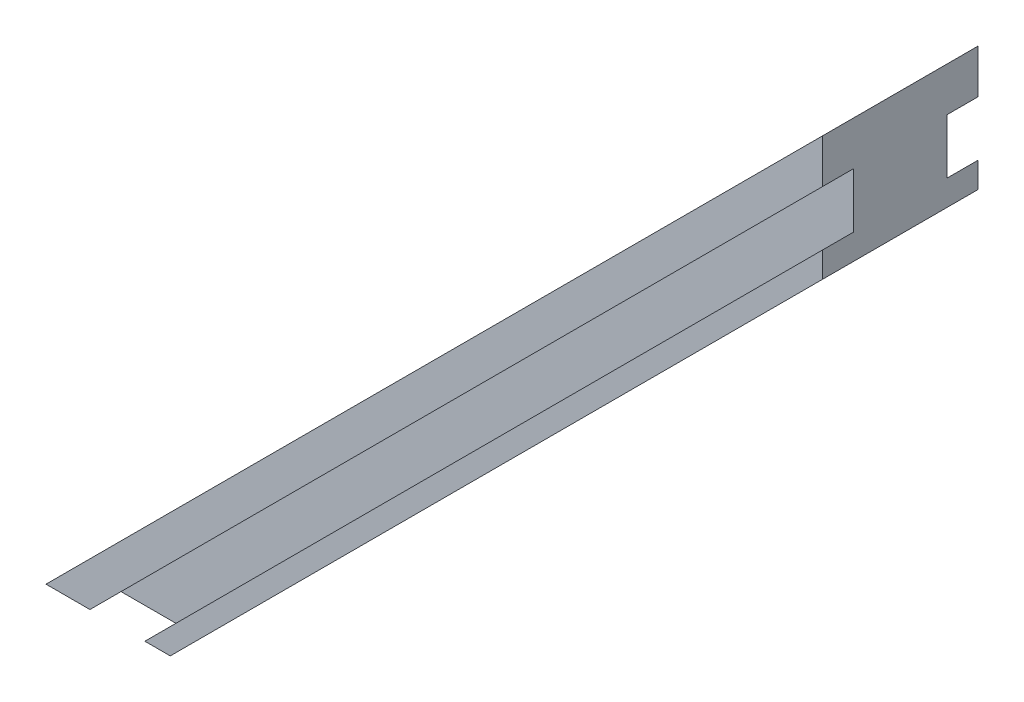
ISO-10303-21;
HEADER;
FILE_DESCRIPTION(('STEP AP214'),'2;1');
FILE_NAME('part.step','',(''),(''),'','','');
FILE_SCHEMA(('AUTOMOTIVE_DESIGN { 1 0 10303 214 1 1 1 1 }'));
ENDSEC;
DATA;
#1=APPLICATION_CONTEXT('core data for automotive mechanical design processes');
#2=APPLICATION_PROTOCOL_DEFINITION('international standard','automotive_design',2000,#1);
#3=PRODUCT_CONTEXT('',#1,'mechanical');
#4=PRODUCT('Part','Part','',(#3));
#5=PRODUCT_RELATED_PRODUCT_CATEGORY('part','',(#4));
#6=PRODUCT_DEFINITION_FORMATION('','',#4);
#7=PRODUCT_DEFINITION_CONTEXT('part definition',#1,'design');
#8=PRODUCT_DEFINITION('design','',#6,#7);
#9=PRODUCT_DEFINITION_SHAPE('','',#8);
#10=(LENGTH_UNIT() NAMED_UNIT(*) SI_UNIT(.MILLI.,.METRE.));
#11=(NAMED_UNIT(*) PLANE_ANGLE_UNIT() SI_UNIT($,.RADIAN.));
#12=(NAMED_UNIT(*) SI_UNIT($,.STERADIAN.) SOLID_ANGLE_UNIT());
#13=UNCERTAINTY_MEASURE_WITH_UNIT(LENGTH_MEASURE(1.E-05),#10,'distance_accuracy_value','');
#14=(GEOMETRIC_REPRESENTATION_CONTEXT(3) GLOBAL_UNCERTAINTY_ASSIGNED_CONTEXT((#13)) GLOBAL_UNIT_ASSIGNED_CONTEXT((#10,
#11,#12)) REPRESENTATION_CONTEXT('',''));
#15=CARTESIAN_POINT('',(0.,0.,0.));
#16=DIRECTION('',(0.,0.,1.));
#17=DIRECTION('',(1.,0.,0.));
#18=AXIS2_PLACEMENT_3D('',#15,#16,#17);
#19=CARTESIAN_POINT('',(-13.6776695296636,-14.6066017177983,0.));
#20=DIRECTION('',(0.707106781186549,-0.707106781186546,0.));
#21=DIRECTION('',(0.707106781186546,0.707106781186549,0.));
#22=AXIS2_PLACEMENT_3D('',#19,#20,#21);
#23=CYLINDRICAL_SURFACE('',#22,1.25);
#24=CARTESIAN_POINT('',(-10.1421356237309,-18.142135623731,0.));
#25=DIRECTION('',(-0.707106781186549,0.707106781186546,0.));
#26=DIRECTION('',(-0.707106781186546,-0.707106781186549,0.));
#27=AXIS2_PLACEMENT_3D('',#24,#25,#26);
#28=CIRCLE('',#27,1.25);
#29=CARTESIAN_POINT('',(-11.0260191002141,-19.0260191002142,0.));
#30=VERTEX_POINT('',#29);
#31=EDGE_CURVE('E210',#30,#30,#28,.T.);
#32=ORIENTED_EDGE('',*,*,#31,.F.);
#33=EDGE_LOOP('',(#32));
#34=FACE_BOUND('',#33,.T.);
#35=CARTESIAN_POINT('',(-13.0814754519511,-15.2027957955108,0.));
#36=DIRECTION('',(-0.707106781186549,0.707106781186546,0.));
#37=DIRECTION('',(-0.707106781186546,-0.707106781186549,0.));
#38=AXIS2_PLACEMENT_3D('',#35,#36,#37);
#39=CIRCLE('',#38,1.25);
#40=CARTESIAN_POINT('',(-13.9653589284343,-16.086679271994,0.));
#41=VERTEX_POINT('',#40);
#42=EDGE_CURVE('E40',#41,#41,#39,.T.);
#43=ORIENTED_EDGE('',*,*,#42,.T.);
#44=EDGE_LOOP('',(#43));
#45=FACE_BOUND('',#44,.T.);
#46=ADVANCED_FACE('F36',(#34,#45),#23,.F.);
#47=CARTESIAN_POINT('',(14.6066017177982,13.6776695296637,0.));
#48=DIRECTION('',(0.707106781186549,-0.707106781186546,0.));
#49=DIRECTION('',(0.707106781186546,0.707106781186549,0.));
#50=AXIS2_PLACEMENT_3D('',#47,#48,#49);
#51=CYLINDRICAL_SURFACE('',#50,1.25);
#52=CARTESIAN_POINT('',(18.1421356237309,10.142135623731,0.));
#53=DIRECTION('',(-0.707106781186549,0.707106781186546,0.));
#54=DIRECTION('',(-0.707106781186546,-0.707106781186549,0.));
#55=AXIS2_PLACEMENT_3D('',#52,#53,#54);
#56=CIRCLE('',#55,1.25);
#57=CARTESIAN_POINT('',(17.2582521472477,9.25825214724781,0.));
#58=VERTEX_POINT('',#57);
#59=EDGE_CURVE('E243',#58,#58,#56,.T.);
#60=ORIENTED_EDGE('',*,*,#59,.F.);
#61=EDGE_LOOP('',(#60));
#62=FACE_BOUND('',#61,.T.);
#63=CARTESIAN_POINT('',(15.2027957955107,13.0814754519512,0.));
#64=DIRECTION('',(-0.707106781186549,0.707106781186546,0.));
#65=DIRECTION('',(-0.707106781186546,-0.707106781186549,0.));
#66=AXIS2_PLACEMENT_3D('',#63,#64,#65);
#67=CIRCLE('',#66,1.25);
#68=CARTESIAN_POINT('',(14.3189123190276,12.197591975468,0.));
#69=VERTEX_POINT('',#68);
#70=EDGE_CURVE('E208',#69,#69,#67,.T.);
#71=ORIENTED_EDGE('',*,*,#70,.T.);
#72=EDGE_LOOP('',(#71));
#73=FACE_BOUND('',#72,.T.);
#74=ADVANCED_FACE('F303',(#62,#73),#51,.F.);
#75=CARTESIAN_POINT('',(-25.,-25.0000000000001,5.));
#76=DIRECTION('',(0.,1.,0.));
#77=DIRECTION('',(0.,0.,1.));
#78=AXIS2_PLACEMENT_3D('',#75,#76,#77);
#79=PLANE('',#78);
#80=DIRECTION('',(0.,0.,-1.));
#81=VECTOR('',#80,1.);
#82=CARTESIAN_POINT('',(-22.171572875254,-25.0000000000001,-3.));
#83=LINE('',#82,#81);
#84=CARTESIAN_POINT('',(-22.171572875254,-25.0000000000001,-3.));
#85=VERTEX_POINT('',#84);
#86=CARTESIAN_POINT('',(-22.171572875254,-25.0000000000001,-5.));
#87=VERTEX_POINT('',#86);
#88=EDGE_CURVE('E150',#85,#87,#83,.T.);
#89=ORIENTED_EDGE('',*,*,#88,.F.);
#90=DIRECTION('',(1.,0.,0.));
#91=VECTOR('',#90,1.);
#92=CARTESIAN_POINT('',(-22.171572875254,-25.0000000000001,-3.));
#93=LINE('',#92,#91);
#94=CARTESIAN_POINT('',(-18.6360389693213,-25.0000000000001,-3.));
#95=VERTEX_POINT('',#94);
#96=EDGE_CURVE('E133',#85,#95,#93,.T.);
#97=ORIENTED_EDGE('',*,*,#96,.T.);
#98=DIRECTION('',(0.,0.,-1.));
#99=VECTOR('',#98,1.);
#100=CARTESIAN_POINT('',(-18.6360389693213,-25.0000000000001,-3.));
#101=LINE('',#100,#99);
#102=CARTESIAN_POINT('',(-18.6360389693213,-25.0000000000001,-5.));
#103=VERTEX_POINT('',#102);
#104=EDGE_CURVE('E129',#95,#103,#101,.T.);
#105=ORIENTED_EDGE('',*,*,#104,.T.);
#106=DIRECTION('',(1.,0.,0.));
#107=VECTOR('',#106,1.);
#108=CARTESIAN_POINT('',(-25.,-25.0000000000001,-5.));
#109=LINE('',#108,#107);
#110=CARTESIAN_POINT('',(-17.,-25.0000000000001,-5.));
#111=VERTEX_POINT('',#110);
#112=EDGE_CURVE('E174',#103,#111,#109,.T.);
#113=ORIENTED_EDGE('',*,*,#112,.T.);
#114=DIRECTION('',(0.,0.,-1.));
#115=VECTOR('',#114,1.);
#116=CARTESIAN_POINT('',(-17.,-25.0000000000001,5.));
#117=LINE('',#116,#115);
#118=CARTESIAN_POINT('',(-17.,-25.0000000000001,5.));
#119=VERTEX_POINT('',#118);
#120=EDGE_CURVE('E12',#119,#111,#117,.T.);
#121=ORIENTED_EDGE('',*,*,#120,.F.);
#122=DIRECTION('',(1.,0.,0.));
#123=VECTOR('',#122,1.);
#124=CARTESIAN_POINT('',(-25.,-25.0000000000001,5.));
#125=LINE('',#124,#123);
#126=CARTESIAN_POINT('',(-18.6360389693213,-25.0000000000001,5.));
#127=VERTEX_POINT('',#126);
#128=EDGE_CURVE('E185',#127,#119,#125,.T.);
#129=ORIENTED_EDGE('',*,*,#128,.F.);
#130=DIRECTION('',(0.,0.,1.));
#131=VECTOR('',#130,1.);
#132=CARTESIAN_POINT('',(-18.6360389693213,-25.0000000000001,3.));
#133=LINE('',#132,#131);
#134=CARTESIAN_POINT('',(-18.6360389693213,-25.0000000000001,3.));
#135=VERTEX_POINT('',#134);
#136=EDGE_CURVE('E175',#135,#127,#133,.T.);
#137=ORIENTED_EDGE('',*,*,#136,.F.);
#138=DIRECTION('',(1.,0.,0.));
#139=VECTOR('',#138,1.);
#140=CARTESIAN_POINT('',(-22.171572875254,-25.0000000000001,3.));
#141=LINE('',#140,#139);
#142=CARTESIAN_POINT('',(-22.171572875254,-25.0000000000001,3.));
#143=VERTEX_POINT('',#142);
#144=EDGE_CURVE('E162',#143,#135,#141,.T.);
#145=ORIENTED_EDGE('',*,*,#144,.F.);
#146=DIRECTION('',(0.,0.,1.));
#147=VECTOR('',#146,1.);
#148=CARTESIAN_POINT('',(-22.171572875254,-25.0000000000001,3.));
#149=LINE('',#148,#147);
#150=CARTESIAN_POINT('',(-22.171572875254,-25.0000000000001,5.));
#151=VERTEX_POINT('',#150);
#152=EDGE_CURVE('E177',#143,#151,#149,.T.);
#153=ORIENTED_EDGE('',*,*,#152,.T.);
#154=CARTESIAN_POINT('',(-25.,-25.0000000000001,5.));
#155=VERTEX_POINT('',#154);
#156=EDGE_CURVE('E181',#155,#151,#125,.T.);
#157=ORIENTED_EDGE('',*,*,#156,.F.);
#158=DIRECTION('',(0.,0.,-1.));
#159=VECTOR('',#158,1.);
#160=CARTESIAN_POINT('',(-25.,-25.0000000000001,5.));
#161=LINE('',#160,#159);
#162=CARTESIAN_POINT('',(-25.,-25.0000000000001,-5.));
#163=VERTEX_POINT('',#162);
#164=EDGE_CURVE('E193',#155,#163,#161,.T.);
#165=ORIENTED_EDGE('',*,*,#164,.T.);
#166=EDGE_CURVE('E194',#163,#87,#109,.T.);
#167=ORIENTED_EDGE('',*,*,#166,.T.);
#168=EDGE_LOOP('',(#89,#97,#105,#113,#121,#129,#137,#145,#153,#157,#165,#167));
#169=FACE_BOUND('',#168,.T.);
#170=ADVANCED_FACE('F38',(#169),#79,.F.);
#171=CARTESIAN_POINT('',(25.,25.0000000000001,5.));
#172=DIRECTION('',(-1.,0.,0.));
#173=DIRECTION('',(0.,0.,1.));
#174=AXIS2_PLACEMENT_3D('',#171,#172,#173);
#175=PLANE('',#174);
#176=DIRECTION('',(0.,0.,-1.));
#177=VECTOR('',#176,1.);
#178=CARTESIAN_POINT('',(25.,22.1715728752539,-3.));
#179=LINE('',#178,#177);
#180=CARTESIAN_POINT('',(25.,22.1715728752539,-3.));
#181=VERTEX_POINT('',#180);
#182=CARTESIAN_POINT('',(25.,22.1715728752539,-5.));
#183=VERTEX_POINT('',#182);
#184=EDGE_CURVE('E169',#181,#183,#179,.T.);
#185=ORIENTED_EDGE('',*,*,#184,.T.);
#186=DIRECTION('',(0.,1.,0.));
#187=VECTOR('',#186,1.);
#188=CARTESIAN_POINT('',(25.,25.0000000000001,-5.));
#189=LINE('',#188,#187);
#190=CARTESIAN_POINT('',(25.,25.0000000000001,-5.));
#191=VERTEX_POINT('',#190);
#192=EDGE_CURVE('E199',#183,#191,#189,.T.);
#193=ORIENTED_EDGE('',*,*,#192,.T.);
#194=DIRECTION('',(0.,0.,-1.));
#195=VECTOR('',#194,1.);
#196=CARTESIAN_POINT('',(25.,25.0000000000001,5.));
#197=LINE('',#196,#195);
#198=CARTESIAN_POINT('',(25.,25.0000000000001,5.));
#199=VERTEX_POINT('',#198);
#200=EDGE_CURVE('E205',#199,#191,#197,.T.);
#201=ORIENTED_EDGE('',*,*,#200,.F.);
#202=DIRECTION('',(0.,1.,0.));
#203=VECTOR('',#202,1.);
#204=CARTESIAN_POINT('',(25.,25.0000000000001,5.));
#205=LINE('',#204,#203);
#206=CARTESIAN_POINT('',(25.,22.1715728752539,5.));
#207=VERTEX_POINT('',#206);
#208=EDGE_CURVE('E187',#207,#199,#205,.T.);
#209=ORIENTED_EDGE('',*,*,#208,.F.);
#210=DIRECTION('',(0.,0.,1.));
#211=VECTOR('',#210,1.);
#212=CARTESIAN_POINT('',(25.,22.1715728752539,3.));
#213=LINE('',#212,#211);
#214=CARTESIAN_POINT('',(25.,22.1715728752539,3.));
#215=VERTEX_POINT('',#214);
#216=EDGE_CURVE('E61',#215,#207,#213,.T.);
#217=ORIENTED_EDGE('',*,*,#216,.F.);
#218=DIRECTION('',(0.,1.,0.));
#219=VECTOR('',#218,1.);
#220=CARTESIAN_POINT('',(25.,18.6360389693212,3.));
#221=LINE('',#220,#219);
#222=CARTESIAN_POINT('',(25.,18.6360389693212,3.));
#223=VERTEX_POINT('',#222);
#224=EDGE_CURVE('E155',#223,#215,#221,.T.);
#225=ORIENTED_EDGE('',*,*,#224,.F.);
#226=DIRECTION('',(0.,0.,1.));
#227=VECTOR('',#226,1.);
#228=CARTESIAN_POINT('',(25.,18.6360389693212,3.));
#229=LINE('',#228,#227);
#230=CARTESIAN_POINT('',(25.,18.6360389693212,5.));
#231=VERTEX_POINT('',#230);
#232=EDGE_CURVE('E171',#223,#231,#229,.T.);
#233=ORIENTED_EDGE('',*,*,#232,.T.);
#234=CARTESIAN_POINT('',(25.,17.0000000000001,5.));
#235=VERTEX_POINT('',#234);
#236=EDGE_CURVE('E188',#235,#231,#205,.T.);
#237=ORIENTED_EDGE('',*,*,#236,.F.);
#238=DIRECTION('',(0.,0.,-1.));
#239=VECTOR('',#238,1.);
#240=CARTESIAN_POINT('',(25.,17.0000000000001,5.));
#241=LINE('',#240,#239);
#242=CARTESIAN_POINT('',(25.,17.0000000000001,-5.));
#243=VERTEX_POINT('',#242);
#244=EDGE_CURVE('E45',#235,#243,#241,.T.);
#245=ORIENTED_EDGE('',*,*,#244,.T.);
#246=CARTESIAN_POINT('',(25.,18.6360389693212,-5.));
#247=VERTEX_POINT('',#246);
#248=EDGE_CURVE('E148',#243,#247,#189,.T.);
#249=ORIENTED_EDGE('',*,*,#248,.T.);
#250=DIRECTION('',(0.,0.,-1.));
#251=VECTOR('',#250,1.);
#252=CARTESIAN_POINT('',(25.,18.6360389693212,-3.));
#253=LINE('',#252,#251);
#254=CARTESIAN_POINT('',(25.,18.6360389693212,-3.));
#255=VERTEX_POINT('',#254);
#256=EDGE_CURVE('E53',#255,#247,#253,.T.);
#257=ORIENTED_EDGE('',*,*,#256,.F.);
#258=DIRECTION('',(0.,1.,0.));
#259=VECTOR('',#258,1.);
#260=CARTESIAN_POINT('',(25.,18.6360389693212,-3.));
#261=LINE('',#260,#259);
#262=EDGE_CURVE('E134',#255,#181,#261,.T.);
#263=ORIENTED_EDGE('',*,*,#262,.T.);
#264=EDGE_LOOP('',(#185,#193,#201,#209,#217,#225,#233,#237,#245,#249,#257,#263));
#265=FACE_BOUND('',#264,.T.);
#266=ADVANCED_FACE('F145',(#265),#175,.F.);
#267=CARTESIAN_POINT('',(0.,0.,-5.));
#268=DIRECTION('',(0.,0.,-1.));
#269=DIRECTION('',(-1.,0.,0.));
#270=AXIS2_PLACEMENT_3D('',#267,#268,#269);
#271=PLANE('',#270);
#272=ORIENTED_EDGE('',*,*,#192,.F.);
#273=DIRECTION('',(-0.707106781186547,-0.707106781186548,0.));
#274=VECTOR('',#273,1.);
#275=CARTESIAN_POINT('',(25.,22.1715728752539,-5.));
#276=LINE('',#275,#274);
#277=EDGE_CURVE('E142',#183,#87,#276,.T.);
#278=ORIENTED_EDGE('',*,*,#277,.T.);
#279=ORIENTED_EDGE('',*,*,#166,.F.);
#280=DIRECTION('',(-0.707106781186546,-0.707106781186549,0.));
#281=VECTOR('',#280,1.);
#282=CARTESIAN_POINT('',(-25.,-25.0000000000001,-5.));
#283=LINE('',#282,#281);
#284=EDGE_CURVE('E201',#191,#163,#283,.T.);
#285=ORIENTED_EDGE('',*,*,#284,.F.);
#286=EDGE_LOOP('',(#272,#278,#279,#285));
#287=FACE_BOUND('',#286,.T.);
#288=ADVANCED_FACE('F260',(#287),#271,.T.);
#289=ORIENTED_EDGE('',*,*,#112,.F.);
#290=DIRECTION('',(0.707106781186547,0.707106781186548,0.));
#291=VECTOR('',#290,1.);
#292=CARTESIAN_POINT('',(-18.6360389693213,-25.0000000000001,-5.));
#293=LINE('',#292,#291);
#294=EDGE_CURVE('E247',#103,#247,#293,.T.);
#295=ORIENTED_EDGE('',*,*,#294,.T.);
#296=ORIENTED_EDGE('',*,*,#248,.F.);
#297=DIRECTION('',(0.707106781186546,0.70710678118655,0.));
#298=VECTOR('',#297,1.);
#299=CARTESIAN_POINT('',(-17.,-25.0000000000001,-5.));
#300=LINE('',#299,#298);
#301=EDGE_CURVE('E197',#111,#243,#300,.T.);
#302=ORIENTED_EDGE('',*,*,#301,.F.);
#303=EDGE_LOOP('',(#289,#295,#296,#302));
#304=FACE_BOUND('',#303,.T.);
#305=ADVANCED_FACE('F293',(#304),#271,.T.);
#306=CARTESIAN_POINT('',(0.,0.,5.));
#307=DIRECTION('',(0.,0.,-1.));
#308=DIRECTION('',(-1.,0.,0.));
#309=AXIS2_PLACEMENT_3D('',#306,#307,#308);
#310=PLANE('',#309);
#311=ORIENTED_EDGE('',*,*,#236,.T.);
#312=DIRECTION('',(0.707106781186547,0.707106781186548,0.));
#313=VECTOR('',#312,1.);
#314=CARTESIAN_POINT('',(-18.6360389693213,-25.0000000000001,5.));
#315=LINE('',#314,#313);
#316=EDGE_CURVE('E159',#127,#231,#315,.T.);
#317=ORIENTED_EDGE('',*,*,#316,.F.);
#318=ORIENTED_EDGE('',*,*,#128,.T.);
#319=DIRECTION('',(0.707106781186546,0.70710678118655,0.));
#320=VECTOR('',#319,1.);
#321=CARTESIAN_POINT('',(-17.,-25.0000000000001,5.));
#322=LINE('',#321,#320);
#323=EDGE_CURVE('E184',#119,#235,#322,.T.);
#324=ORIENTED_EDGE('',*,*,#323,.T.);
#325=EDGE_LOOP('',(#311,#317,#318,#324));
#326=FACE_BOUND('',#325,.T.);
#327=ADVANCED_FACE('F284',(#326),#310,.F.);
#328=CARTESIAN_POINT('',(-17.,-25.0000000000001,5.));
#329=DIRECTION('',(-0.70710678118655,0.707106781186546,0.));
#330=DIRECTION('',(-0.707106781186546,-0.70710678118655,0.));
#331=AXIS2_PLACEMENT_3D('',#328,#329,#330);
#332=PLANE('',#331);
#333=CARTESIAN_POINT('',(4.00000000000001,-3.99999999999999,0.));
#334=DIRECTION('',(-0.707106781186549,0.707106781186546,0.));
#335=DIRECTION('',(-0.707106781186546,-0.707106781186549,0.));
#336=AXIS2_PLACEMENT_3D('',#333,#334,#335);
#337=CIRCLE('',#336,1.25);
#338=CARTESIAN_POINT('',(3.11611652351683,-4.88388347648318,0.));
#339=VERTEX_POINT('',#338);
#340=EDGE_CURVE('E232',#339,#339,#337,.T.);
#341=ORIENTED_EDGE('',*,*,#340,.T.);
#342=EDGE_LOOP('',(#341));
#343=FACE_BOUND('',#342,.T.);
#344=CARTESIAN_POINT('',(-3.07106781186544,-11.0710678118655,0.));
#345=DIRECTION('',(-0.707106781186549,0.707106781186546,0.));
#346=DIRECTION('',(-0.707106781186546,-0.707106781186549,0.));
#347=AXIS2_PLACEMENT_3D('',#344,#345,#346);
#348=CIRCLE('',#347,1.25);
#349=CARTESIAN_POINT('',(-3.95495128834863,-11.9549512883487,0.));
#350=VERTEX_POINT('',#349);
#351=EDGE_CURVE('E215',#350,#350,#348,.T.);
#352=ORIENTED_EDGE('',*,*,#351,.T.);
#353=EDGE_LOOP('',(#352));
#354=FACE_BOUND('',#353,.T.);
#355=ORIENTED_EDGE('',*,*,#31,.T.);
#356=EDGE_LOOP('',(#355));
#357=FACE_BOUND('',#356,.T.);
#358=CARTESIAN_POINT('',(11.0710678118655,3.0710678118655,0.));
#359=DIRECTION('',(-0.707106781186549,0.707106781186546,0.));
#360=DIRECTION('',(-0.707106781186546,-0.707106781186549,0.));
#361=AXIS2_PLACEMENT_3D('',#358,#359,#360);
#362=CIRCLE('',#361,1.25);
#363=CARTESIAN_POINT('',(10.1871843353823,2.18718433538231,0.));
#364=VERTEX_POINT('',#363);
#365=EDGE_CURVE('E231',#364,#364,#362,.T.);
#366=ORIENTED_EDGE('',*,*,#365,.T.);
#367=EDGE_LOOP('',(#366));
#368=FACE_BOUND('',#367,.T.);
#369=ORIENTED_EDGE('',*,*,#59,.T.);
#370=EDGE_LOOP('',(#369));
#371=FACE_BOUND('',#370,.T.);
#372=ORIENTED_EDGE('',*,*,#301,.T.);
#373=ORIENTED_EDGE('',*,*,#244,.F.);
#374=ORIENTED_EDGE('',*,*,#323,.F.);
#375=ORIENTED_EDGE('',*,*,#120,.T.);
#376=EDGE_LOOP('',(#372,#373,#374,#375));
#377=FACE_BOUND('',#376,.T.);
#378=ADVANCED_FACE('F289',(#343,#354,#357,#368,#371,#377),#332,.F.);
#379=CARTESIAN_POINT('',(-25.,-25.0000000000001,5.));
#380=DIRECTION('',(0.707106781186549,-0.707106781186546,0.));
#381=DIRECTION('',(0.707106781186546,0.707106781186549,0.));
#382=AXIS2_PLACEMENT_3D('',#379,#380,#381);
#383=PLANE('',#382);
#384=CARTESIAN_POINT('',(-14.1421356237309,-14.142135623731,0.));
#385=DIRECTION('',(-0.707106781186549,0.707106781186546,0.));
#386=DIRECTION('',(-0.707106781186546,-0.707106781186549,0.));
#387=AXIS2_PLACEMENT_3D('',#384,#385,#386);
#388=CIRCLE('',#387,3.5);
#389=CARTESIAN_POINT('',(-16.6170093578838,-16.6170093578839,0.));
#390=VERTEX_POINT('',#389);
#391=EDGE_CURVE('E225',#390,#390,#388,.T.);
#392=ORIENTED_EDGE('',*,*,#391,.F.);
#393=EDGE_LOOP('',(#392));
#394=FACE_BOUND('',#393,.T.);
#395=CARTESIAN_POINT('',(14.1421356237309,14.142135623731,0.));
#396=DIRECTION('',(-0.707106781186549,0.707106781186546,0.));
#397=DIRECTION('',(-0.707106781186546,-0.707106781186549,0.));
#398=AXIS2_PLACEMENT_3D('',#395,#396,#397);
#399=CIRCLE('',#398,3.5);
#400=CARTESIAN_POINT('',(11.667261889578,11.6672618895781,0.));
#401=VERTEX_POINT('',#400);
#402=EDGE_CURVE('E218',#401,#401,#399,.T.);
#403=ORIENTED_EDGE('',*,*,#402,.F.);
#404=EDGE_LOOP('',(#403));
#405=FACE_BOUND('',#404,.T.);
#406=ORIENTED_EDGE('',*,*,#284,.T.);
#407=ORIENTED_EDGE('',*,*,#164,.F.);
#408=DIRECTION('',(-0.707106781186546,-0.707106781186549,0.));
#409=VECTOR('',#408,1.);
#410=CARTESIAN_POINT('',(-25.,-25.0000000000001,5.));
#411=LINE('',#410,#409);
#412=EDGE_CURVE('E191',#199,#155,#411,.T.);
#413=ORIENTED_EDGE('',*,*,#412,.F.);
#414=ORIENTED_EDGE('',*,*,#200,.T.);
#415=EDGE_LOOP('',(#406,#407,#413,#414));
#416=FACE_BOUND('',#415,.T.);
#417=ADVANCED_FACE('F266',(#394,#405,#416),#383,.F.);
#418=ORIENTED_EDGE('',*,*,#156,.T.);
#419=DIRECTION('',(-0.707106781186547,-0.707106781186548,0.));
#420=VECTOR('',#419,1.);
#421=CARTESIAN_POINT('',(25.,22.1715728752539,5.));
#422=LINE('',#421,#420);
#423=EDGE_CURVE('E167',#207,#151,#422,.T.);
#424=ORIENTED_EDGE('',*,*,#423,.F.);
#425=ORIENTED_EDGE('',*,*,#208,.T.);
#426=ORIENTED_EDGE('',*,*,#412,.T.);
#427=EDGE_LOOP('',(#418,#424,#425,#426));
#428=FACE_BOUND('',#427,.T.);
#429=ADVANCED_FACE('F271',(#428),#310,.F.);
#430=CARTESIAN_POINT('',(-18.6360389693213,-25.0000000000001,3.));
#431=DIRECTION('',(0.707106781186548,-0.707106781186547,0.));
#432=DIRECTION('',(0.707106781186547,0.707106781186548,0.));
#433=AXIS2_PLACEMENT_3D('',#430,#431,#432);
#434=PLANE('',#433);
#435=ORIENTED_EDGE('',*,*,#316,.T.);
#436=ORIENTED_EDGE('',*,*,#232,.F.);
#437=DIRECTION('',(0.707106781186547,0.707106781186548,0.));
#438=VECTOR('',#437,1.);
#439=CARTESIAN_POINT('',(-18.6360389693213,-25.0000000000001,3.));
#440=LINE('',#439,#438);
#441=EDGE_CURVE('E164',#135,#223,#440,.T.);
#442=ORIENTED_EDGE('',*,*,#441,.F.);
#443=ORIENTED_EDGE('',*,*,#136,.T.);
#444=EDGE_LOOP('',(#435,#436,#442,#443));
#445=FACE_BOUND('',#444,.T.);
#446=ADVANCED_FACE('F280',(#445),#434,.F.);
#447=CARTESIAN_POINT('',(25.,22.1715728752539,3.));
#448=DIRECTION('',(-0.707106781186548,0.707106781186547,0.));
#449=DIRECTION('',(-0.707106781186547,-0.707106781186548,0.));
#450=AXIS2_PLACEMENT_3D('',#447,#448,#449);
#451=PLANE('',#450);
#452=ORIENTED_EDGE('',*,*,#423,.T.);
#453=ORIENTED_EDGE('',*,*,#152,.F.);
#454=DIRECTION('',(-0.707106781186547,-0.707106781186548,0.));
#455=VECTOR('',#454,1.);
#456=CARTESIAN_POINT('',(25.,22.1715728752539,3.));
#457=LINE('',#456,#455);
#458=EDGE_CURVE('E158',#215,#143,#457,.T.);
#459=ORIENTED_EDGE('',*,*,#458,.F.);
#460=ORIENTED_EDGE('',*,*,#216,.T.);
#461=EDGE_LOOP('',(#452,#453,#459,#460));
#462=FACE_BOUND('',#461,.T.);
#463=ADVANCED_FACE('F272',(#462),#451,.F.);
#464=CARTESIAN_POINT('',(0.,0.,3.));
#465=DIRECTION('',(0.,0.,-1.));
#466=DIRECTION('',(-1.,0.,0.));
#467=AXIS2_PLACEMENT_3D('',#464,#465,#466);
#468=PLANE('',#467);
#469=ORIENTED_EDGE('',*,*,#224,.T.);
#470=ORIENTED_EDGE('',*,*,#458,.T.);
#471=ORIENTED_EDGE('',*,*,#144,.T.);
#472=ORIENTED_EDGE('',*,*,#441,.T.);
#473=EDGE_LOOP('',(#469,#470,#471,#472));
#474=FACE_BOUND('',#473,.T.);
#475=ADVANCED_FACE('F278',(#474),#468,.F.);
#476=CARTESIAN_POINT('',(25.,22.1715728752539,-3.));
#477=DIRECTION('',(0.707106781186548,-0.707106781186547,0.));
#478=DIRECTION('',(0.707106781186547,0.707106781186548,0.));
#479=AXIS2_PLACEMENT_3D('',#476,#477,#478);
#480=PLANE('',#479);
#481=ORIENTED_EDGE('',*,*,#277,.F.);
#482=ORIENTED_EDGE('',*,*,#184,.F.);
#483=DIRECTION('',(-0.707106781186547,-0.707106781186548,0.));
#484=VECTOR('',#483,1.);
#485=CARTESIAN_POINT('',(25.,22.1715728752539,-3.));
#486=LINE('',#485,#484);
#487=EDGE_CURVE('E138',#181,#85,#486,.T.);
#488=ORIENTED_EDGE('',*,*,#487,.T.);
#489=ORIENTED_EDGE('',*,*,#88,.T.);
#490=EDGE_LOOP('',(#481,#482,#488,#489));
#491=FACE_BOUND('',#490,.T.);
#492=ADVANCED_FACE('F255',(#491),#480,.T.);
#493=CARTESIAN_POINT('',(-18.6360389693213,-25.0000000000001,-3.));
#494=DIRECTION('',(-0.707106781186548,0.707106781186547,0.));
#495=DIRECTION('',(-0.707106781186547,-0.707106781186548,0.));
#496=AXIS2_PLACEMENT_3D('',#493,#494,#495);
#497=PLANE('',#496);
#498=ORIENTED_EDGE('',*,*,#294,.F.);
#499=ORIENTED_EDGE('',*,*,#104,.F.);
#500=DIRECTION('',(0.707106781186547,0.707106781186548,0.));
#501=VECTOR('',#500,1.);
#502=CARTESIAN_POINT('',(-18.6360389693213,-25.0000000000001,-3.));
#503=LINE('',#502,#501);
#504=EDGE_CURVE('E125',#95,#255,#503,.T.);
#505=ORIENTED_EDGE('',*,*,#504,.T.);
#506=ORIENTED_EDGE('',*,*,#256,.T.);
#507=EDGE_LOOP('',(#498,#499,#505,#506));
#508=FACE_BOUND('',#507,.T.);
#509=ADVANCED_FACE('F127',(#508),#497,.T.);
#510=CARTESIAN_POINT('',(0.,0.,-3.));
#511=DIRECTION('',(0.,0.,1.));
#512=DIRECTION('',(-1.,0.,0.));
#513=AXIS2_PLACEMENT_3D('',#510,#511,#512);
#514=PLANE('',#513);
#515=ORIENTED_EDGE('',*,*,#262,.F.);
#516=ORIENTED_EDGE('',*,*,#504,.F.);
#517=ORIENTED_EDGE('',*,*,#96,.F.);
#518=ORIENTED_EDGE('',*,*,#487,.F.);
#519=EDGE_LOOP('',(#515,#516,#517,#518));
#520=FACE_BOUND('',#519,.T.);
#521=ADVANCED_FACE('F137',(#520),#514,.F.);
#522=CARTESIAN_POINT('',(7.53553390593272,6.60660171779823,0.));
#523=DIRECTION('',(0.707106781186549,-0.707106781186546,0.));
#524=DIRECTION('',(0.707106781186546,0.707106781186549,0.));
#525=AXIS2_PLACEMENT_3D('',#522,#523,#524);
#526=CYLINDRICAL_SURFACE('',#525,1.25);
#527=CARTESIAN_POINT('',(7.53553390593272,6.60660171779823,0.));
#528=DIRECTION('',(-0.707106781186549,0.707106781186546,0.));
#529=DIRECTION('',(-0.707106781186546,-0.707106781186549,0.));
#530=AXIS2_PLACEMENT_3D('',#527,#528,#529);
#531=CIRCLE('',#530,1.25);
#532=CARTESIAN_POINT('',(6.65165042944954,5.72271824131504,0.));
#533=VERTEX_POINT('',#532);
#534=EDGE_CURVE('E240',#533,#533,#531,.T.);
#535=ORIENTED_EDGE('',*,*,#534,.T.);
#536=EDGE_LOOP('',(#535));
#537=FACE_BOUND('',#536,.T.);
#538=ORIENTED_EDGE('',*,*,#365,.F.);
#539=EDGE_LOOP('',(#538));
#540=FACE_BOUND('',#539,.T.);
#541=ADVANCED_FACE('F320',(#537,#540),#526,.F.);
#542=CARTESIAN_POINT('',(7.53553390593272,6.60660171779823,0.));
#543=DIRECTION('',(-0.707106781186549,0.707106781186546,0.));
#544=DIRECTION('',(-0.707106781186546,-0.707106781186549,0.));
#545=AXIS2_PLACEMENT_3D('',#542,#543,#544);
#546=PLANE('',#545);
#547=ORIENTED_EDGE('',*,*,#534,.F.);
#548=EDGE_LOOP('',(#547));
#549=FACE_BOUND('',#548,.T.);
#550=ADVANCED_FACE('F317',(#549),#546,.F.);
#551=CARTESIAN_POINT('',(-6.60660171779819,-7.53553390593276,0.));
#552=DIRECTION('',(0.707106781186549,-0.707106781186546,0.));
#553=DIRECTION('',(0.707106781186546,0.707106781186549,0.));
#554=AXIS2_PLACEMENT_3D('',#551,#552,#553);
#555=CYLINDRICAL_SURFACE('',#554,1.25);
#556=CARTESIAN_POINT('',(-6.60660171779819,-7.53553390593276,0.));
#557=DIRECTION('',(-0.707106781186549,0.707106781186546,0.));
#558=DIRECTION('',(-0.707106781186546,-0.707106781186549,0.));
#559=AXIS2_PLACEMENT_3D('',#556,#557,#558);
#560=CIRCLE('',#559,1.25);
#561=CARTESIAN_POINT('',(-7.49048519428137,-8.41941738241595,0.));
#562=VERTEX_POINT('',#561);
#563=EDGE_CURVE('E235',#562,#562,#560,.T.);
#564=ORIENTED_EDGE('',*,*,#563,.T.);
#565=EDGE_LOOP('',(#564));
#566=FACE_BOUND('',#565,.T.);
#567=ORIENTED_EDGE('',*,*,#351,.F.);
#568=EDGE_LOOP('',(#567));
#569=FACE_BOUND('',#568,.T.);
#570=ADVANCED_FACE('F315',(#566,#569),#555,.F.);
#571=CARTESIAN_POINT('',(-6.60660171779819,-7.53553390593276,0.));
#572=DIRECTION('',(-0.707106781186549,0.707106781186546,0.));
#573=DIRECTION('',(-0.707106781186546,-0.707106781186549,0.));
#574=AXIS2_PLACEMENT_3D('',#571,#572,#573);
#575=PLANE('',#574);
#576=ORIENTED_EDGE('',*,*,#563,.F.);
#577=EDGE_LOOP('',(#576));
#578=FACE_BOUND('',#577,.T.);
#579=ADVANCED_FACE('F422',(#578),#575,.F.);
#580=CARTESIAN_POINT('',(0.464466094067265,-0.464466094067267,0.));
#581=DIRECTION('',(0.707106781186549,-0.707106781186546,0.));
#582=DIRECTION('',(0.707106781186546,0.707106781186549,0.));
#583=AXIS2_PLACEMENT_3D('',#580,#581,#582);
#584=CYLINDRICAL_SURFACE('',#583,1.25);
#585=CARTESIAN_POINT('',(0.464466094067265,-0.464466094067267,0.));
#586=DIRECTION('',(-0.707106781186549,0.707106781186546,0.));
#587=DIRECTION('',(-0.707106781186546,-0.707106781186549,0.));
#588=AXIS2_PLACEMENT_3D('',#585,#586,#587);
#589=CIRCLE('',#588,1.25);
#590=CARTESIAN_POINT('',(-0.419417382415918,-1.34834957055045,0.));
#591=VERTEX_POINT('',#590);
#592=EDGE_CURVE('E228',#591,#591,#589,.T.);
#593=ORIENTED_EDGE('',*,*,#592,.T.);
#594=EDGE_LOOP('',(#593));
#595=FACE_BOUND('',#594,.T.);
#596=ORIENTED_EDGE('',*,*,#340,.F.);
#597=EDGE_LOOP('',(#596));
#598=FACE_BOUND('',#597,.T.);
#599=ADVANCED_FACE('F419',(#595,#598),#584,.F.);
#600=CARTESIAN_POINT('',(0.464466094067265,-0.464466094067267,0.));
#601=DIRECTION('',(-0.707106781186549,0.707106781186546,0.));
#602=DIRECTION('',(-0.707106781186546,-0.707106781186549,0.));
#603=AXIS2_PLACEMENT_3D('',#600,#601,#602);
#604=PLANE('',#603);
#605=ORIENTED_EDGE('',*,*,#592,.F.);
#606=EDGE_LOOP('',(#605));
#607=FACE_BOUND('',#606,.T.);
#608=ADVANCED_FACE('F380',(#607),#604,.F.);
#609=CARTESIAN_POINT('',(15.2027957955107,13.0814754519512,0.));
#610=DIRECTION('',(-0.707106781186549,0.707106781186546,0.));
#611=DIRECTION('',(-0.707106781186546,-0.707106781186549,0.));
#612=AXIS2_PLACEMENT_3D('',#609,#610,#611);
#613=CYLINDRICAL_SURFACE('',#612,3.5);
#614=CARTESIAN_POINT('',(15.2027957955107,13.0814754519512,0.));
#615=DIRECTION('',(-0.707106781186549,0.707106781186546,0.));
#616=DIRECTION('',(-0.707106781186546,-0.707106781186549,0.));
#617=AXIS2_PLACEMENT_3D('',#614,#615,#616);
#618=CIRCLE('',#617,3.5);
#619=CARTESIAN_POINT('',(12.7279220613578,10.6066017177983,0.));
#620=VERTEX_POINT('',#619);
#621=EDGE_CURVE('E211',#620,#620,#618,.T.);
#622=ORIENTED_EDGE('',*,*,#621,.F.);
#623=EDGE_LOOP('',(#622));
#624=FACE_BOUND('',#623,.T.);
#625=ORIENTED_EDGE('',*,*,#402,.T.);
#626=EDGE_LOOP('',(#625));
#627=FACE_BOUND('',#626,.T.);
#628=ADVANCED_FACE('F374',(#624,#627),#613,.F.);
#629=CARTESIAN_POINT('',(15.2027957955107,13.0814754519512,0.));
#630=DIRECTION('',(-0.707106781186549,0.707106781186546,0.));
#631=DIRECTION('',(-0.707106781186546,-0.707106781186549,0.));
#632=AXIS2_PLACEMENT_3D('',#629,#630,#631);
#633=PLANE('',#632);
#634=ORIENTED_EDGE('',*,*,#70,.F.);
#635=EDGE_LOOP('',(#634));
#636=FACE_BOUND('',#635,.T.);
#637=ORIENTED_EDGE('',*,*,#621,.T.);
#638=EDGE_LOOP('',(#637));
#639=FACE_BOUND('',#638,.T.);
#640=ADVANCED_FACE('F379',(#636,#639),#633,.T.);
#641=CARTESIAN_POINT('',(-13.0814754519511,-15.2027957955108,0.));
#642=DIRECTION('',(-0.707106781186549,0.707106781186546,0.));
#643=DIRECTION('',(-0.707106781186546,-0.707106781186549,0.));
#644=AXIS2_PLACEMENT_3D('',#641,#642,#643);
#645=CYLINDRICAL_SURFACE('',#644,3.5);
#646=CARTESIAN_POINT('',(-13.0814754519511,-15.2027957955108,0.));
#647=DIRECTION('',(-0.707106781186549,0.707106781186546,0.));
#648=DIRECTION('',(-0.707106781186546,-0.707106781186549,0.));
#649=AXIS2_PLACEMENT_3D('',#646,#647,#648);
#650=CIRCLE('',#649,3.5);
#651=CARTESIAN_POINT('',(-15.556349186104,-17.6776695296637,0.));
#652=VERTEX_POINT('',#651);
#653=EDGE_CURVE('E543',#652,#652,#650,.T.);
#654=ORIENTED_EDGE('',*,*,#653,.F.);
#655=EDGE_LOOP('',(#654));
#656=FACE_BOUND('',#655,.T.);
#657=ORIENTED_EDGE('',*,*,#391,.T.);
#658=EDGE_LOOP('',(#657));
#659=FACE_BOUND('',#658,.T.);
#660=ADVANCED_FACE('F391',(#656,#659),#645,.F.);
#661=CARTESIAN_POINT('',(-13.0814754519511,-15.2027957955108,0.));
#662=DIRECTION('',(-0.707106781186549,0.707106781186546,0.));
#663=DIRECTION('',(-0.707106781186546,-0.707106781186549,0.));
#664=AXIS2_PLACEMENT_3D('',#661,#662,#663);
#665=PLANE('',#664);
#666=ORIENTED_EDGE('',*,*,#42,.F.);
#667=EDGE_LOOP('',(#666));
#668=FACE_BOUND('',#667,.T.);
#669=ORIENTED_EDGE('',*,*,#653,.T.);
#670=EDGE_LOOP('',(#669));
#671=FACE_BOUND('',#670,.T.);
#672=ADVANCED_FACE('F401',(#668,#671),#665,.T.);
#673=CLOSED_SHELL('',(#46,#74,#170,#266,#288,#305,#327,#378,#417,#429,#446,#463,#475,#492,#509,
#521,#541,#550,#570,#579,#599,#608,#628,#640,#660,#672));
#674=MANIFOLD_SOLID_BREP('B2',#673);
#675=ADVANCED_BREP_SHAPE_REPRESENTATION('',(#18,#674),#14);
#676=SHAPE_DEFINITION_REPRESENTATION(#9,#675);
ENDSEC;
END-ISO-10303-21;
